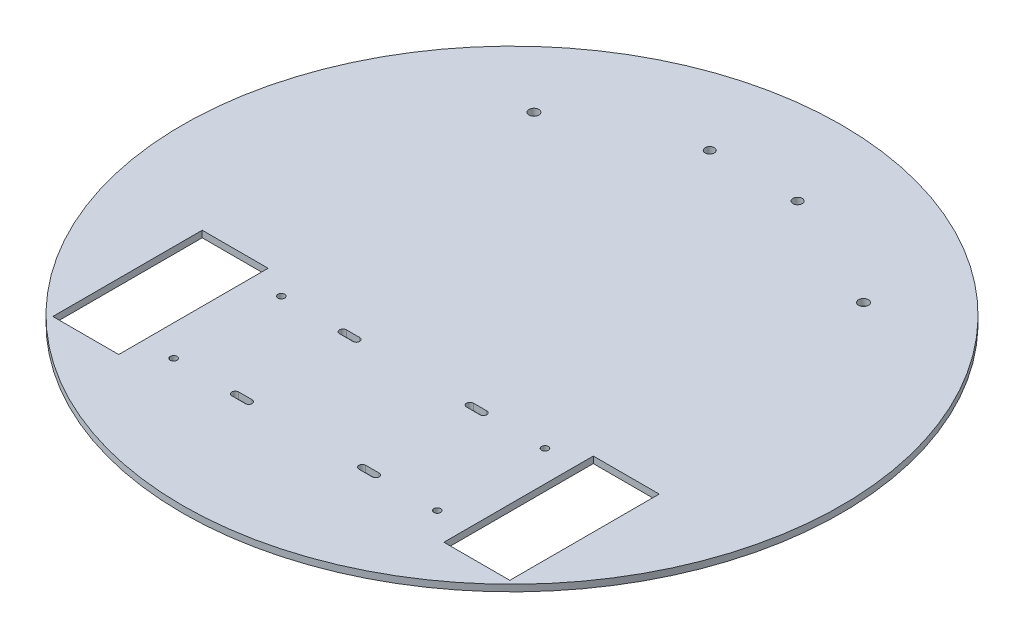
ISO-10303-21;
HEADER;
FILE_DESCRIPTION(('STEP AP214'),'2;1');
FILE_NAME('part.step','',(''),(''),'','','');
FILE_SCHEMA(('AUTOMOTIVE_DESIGN { 1 0 10303 214 1 1 1 1 }'));
ENDSEC;
DATA;
#1=APPLICATION_CONTEXT('core data for automotive mechanical design processes');
#2=APPLICATION_PROTOCOL_DEFINITION('international standard','automotive_design',2000,#1);
#3=PRODUCT_CONTEXT('',#1,'mechanical');
#4=PRODUCT('Part','Part','',(#3));
#5=PRODUCT_RELATED_PRODUCT_CATEGORY('part','',(#4));
#6=PRODUCT_DEFINITION_FORMATION('','',#4);
#7=PRODUCT_DEFINITION_CONTEXT('part definition',#1,'design');
#8=PRODUCT_DEFINITION('design','',#6,#7);
#9=PRODUCT_DEFINITION_SHAPE('','',#8);
#10=(LENGTH_UNIT() NAMED_UNIT(*) SI_UNIT(.MILLI.,.METRE.));
#11=(NAMED_UNIT(*) PLANE_ANGLE_UNIT() SI_UNIT($,.RADIAN.));
#12=(NAMED_UNIT(*) SI_UNIT($,.STERADIAN.) SOLID_ANGLE_UNIT());
#13=UNCERTAINTY_MEASURE_WITH_UNIT(LENGTH_MEASURE(1.E-05),#10,'distance_accuracy_value','');
#14=(GEOMETRIC_REPRESENTATION_CONTEXT(3) GLOBAL_UNCERTAINTY_ASSIGNED_CONTEXT((#13)) GLOBAL_UNIT_ASSIGNED_CONTEXT((#10,
#11,#12)) REPRESENTATION_CONTEXT('',''));
#15=CARTESIAN_POINT('',(0.,0.,0.));
#16=DIRECTION('',(0.,0.,1.));
#17=DIRECTION('',(1.,0.,0.));
#18=AXIS2_PLACEMENT_3D('',#15,#16,#17);
#19=CARTESIAN_POINT('',(0.,3.,0.));
#20=DIRECTION('',(0.,1.,0.));
#21=DIRECTION('',(0.,0.,1.));
#22=AXIS2_PLACEMENT_3D('',#19,#20,#21);
#23=PLANE('',#22);
#24=CARTESIAN_POINT('',(-20.,3.,-110.));
#25=DIRECTION('',(0.,1.,0.));
#26=DIRECTION('',(0.,0.,1.));
#27=AXIS2_PLACEMENT_3D('',#24,#25,#26);
#28=CIRCLE('',#27,2.1);
#29=CARTESIAN_POINT('',(-20.,3.,-107.9));
#30=VERTEX_POINT('',#29);
#31=EDGE_CURVE('E438',#30,#30,#28,.T.);
#32=ORIENTED_EDGE('',*,*,#31,.F.);
#33=EDGE_LOOP('',(#32));
#34=FACE_BOUND('',#33,.T.);
#35=CARTESIAN_POINT('',(-75.,3.,-85.));
#36=DIRECTION('',(0.,1.,0.));
#37=DIRECTION('',(0.,0.,1.));
#38=AXIS2_PLACEMENT_3D('',#35,#36,#37);
#39=CIRCLE('',#38,2.25);
#40=CARTESIAN_POINT('',(-75.,3.,-82.75));
#41=VERTEX_POINT('',#40);
#42=EDGE_CURVE('E223',#41,#41,#39,.T.);
#43=ORIENTED_EDGE('',*,*,#42,.F.);
#44=EDGE_LOOP('',(#43));
#45=FACE_BOUND('',#44,.T.);
#46=CARTESIAN_POINT('',(59.9999999999999,3.,93.9999999999998));
#47=DIRECTION('',(0.,1.,0.));
#48=DIRECTION('',(0.,0.,-1.));
#49=AXIS2_PLACEMENT_3D('',#46,#47,#48);
#50=CIRCLE('',#49,1.55);
#51=CARTESIAN_POINT('',(59.9999999999999,3.,92.4499999999998));
#52=VERTEX_POINT('',#51);
#53=EDGE_CURVE('E239',#52,#52,#50,.T.);
#54=ORIENTED_EDGE('',*,*,#53,.F.);
#55=EDGE_LOOP('',(#54));
#56=FACE_BOUND('',#55,.T.);
#57=DIRECTION('',(1.,0.,0.));
#58=VECTOR('',#57,1.);
#59=CARTESIAN_POINT('',(-31.95,3.,46.55));
#60=LINE('',#59,#58);
#61=CARTESIAN_POINT('',(-31.95,3.,46.55));
#62=VERTEX_POINT('',#61);
#63=CARTESIAN_POINT('',(-25.85,3.,46.55));
#64=VERTEX_POINT('',#63);
#65=EDGE_CURVE('E377',#62,#64,#60,.T.);
#66=ORIENTED_EDGE('',*,*,#65,.F.);
#67=CARTESIAN_POINT('',(-31.95,3.,45.));
#68=DIRECTION('',(0.,1.,0.));
#69=DIRECTION('',(0.,0.,1.));
#70=AXIS2_PLACEMENT_3D('',#67,#68,#69);
#71=CIRCLE('',#70,1.55000000000001);
#72=CARTESIAN_POINT('',(-31.95,3.,43.45));
#73=VERTEX_POINT('',#72);
#74=EDGE_CURVE('E375',#73,#62,#71,.T.);
#75=ORIENTED_EDGE('',*,*,#74,.F.);
#76=DIRECTION('',(-1.,0.,0.));
#77=VECTOR('',#76,1.);
#78=CARTESIAN_POINT('',(-31.95,3.,43.45));
#79=LINE('',#78,#77);
#80=CARTESIAN_POINT('',(-25.85,3.,43.45));
#81=VERTEX_POINT('',#80);
#82=EDGE_CURVE('E383',#81,#73,#79,.T.);
#83=ORIENTED_EDGE('',*,*,#82,.F.);
#84=CARTESIAN_POINT('',(-25.85,3.,45.));
#85=DIRECTION('',(0.,1.,0.));
#86=DIRECTION('',(0.,0.,1.));
#87=AXIS2_PLACEMENT_3D('',#84,#85,#86);
#88=CIRCLE('',#87,1.55000000000001);
#89=EDGE_CURVE('E380',#64,#81,#88,.T.);
#90=ORIENTED_EDGE('',*,*,#89,.F.);
#91=EDGE_LOOP('',(#66,#75,#83,#90));
#92=FACE_BOUND('',#91,.T.);
#93=CARTESIAN_POINT('',(-60.,3.,45.));
#94=DIRECTION('',(0.,1.,0.));
#95=DIRECTION('',(0.,0.,1.));
#96=AXIS2_PLACEMENT_3D('',#93,#94,#95);
#97=CIRCLE('',#96,1.54999999999999);
#98=CARTESIAN_POINT('',(-60.,3.,46.55));
#99=VERTEX_POINT('',#98);
#100=EDGE_CURVE('E406',#99,#99,#97,.T.);
#101=ORIENTED_EDGE('',*,*,#100,.F.);
#102=EDGE_LOOP('',(#101));
#103=FACE_BOUND('',#102,.T.);
#104=CARTESIAN_POINT('',(0.,3.,0.));
#105=DIRECTION('',(0.,1.,0.));
#106=DIRECTION('',(0.,0.,1.));
#107=AXIS2_PLACEMENT_3D('',#104,#105,#106);
#108=CIRCLE('',#107,150.);
#109=CARTESIAN_POINT('',(0.,3.,150.));
#110=VERTEX_POINT('',#109);
#111=EDGE_CURVE('E11',#110,#110,#108,.T.);
#112=ORIENTED_EDGE('',*,*,#111,.T.);
#113=EDGE_LOOP('',(#112));
#114=FACE_BOUND('',#113,.T.);
#115=CARTESIAN_POINT('',(-59.9999999999999,3.,94.));
#116=DIRECTION('',(0.,1.,0.));
#117=DIRECTION('',(0.,0.,1.));
#118=AXIS2_PLACEMENT_3D('',#115,#116,#117);
#119=CIRCLE('',#118,1.55);
#120=CARTESIAN_POINT('',(-59.9999999999999,3.,95.55));
#121=VERTEX_POINT('',#120);
#122=EDGE_CURVE('E369',#121,#121,#119,.T.);
#123=ORIENTED_EDGE('',*,*,#122,.F.);
#124=EDGE_LOOP('',(#123));
#125=FACE_BOUND('',#124,.T.);
#126=DIRECTION('',(1.,0.,0.));
#127=VECTOR('',#126,1.);
#128=CARTESIAN_POINT('',(-31.9499999999999,3.,95.55));
#129=LINE('',#128,#127);
#130=CARTESIAN_POINT('',(-31.9499999999999,3.,95.55));
#131=VERTEX_POINT('',#130);
#132=CARTESIAN_POINT('',(-25.8499999999999,3.,95.55));
#133=VERTEX_POINT('',#132);
#134=EDGE_CURVE('E340',#131,#133,#129,.T.);
#135=ORIENTED_EDGE('',*,*,#134,.F.);
#136=CARTESIAN_POINT('',(-31.9499999999999,3.,94.));
#137=DIRECTION('',(0.,1.,0.));
#138=DIRECTION('',(0.,0.,1.));
#139=AXIS2_PLACEMENT_3D('',#136,#137,#138);
#140=CIRCLE('',#139,1.55);
#141=CARTESIAN_POINT('',(-31.9499999999999,3.,92.45));
#142=VERTEX_POINT('',#141);
#143=EDGE_CURVE('E338',#142,#131,#140,.T.);
#144=ORIENTED_EDGE('',*,*,#143,.F.);
#145=DIRECTION('',(-1.,0.,0.));
#146=VECTOR('',#145,1.);
#147=CARTESIAN_POINT('',(-31.9499999999999,3.,92.45));
#148=LINE('',#147,#146);
#149=CARTESIAN_POINT('',(-25.8499999999999,3.,92.45));
#150=VERTEX_POINT('',#149);
#151=EDGE_CURVE('E346',#150,#142,#148,.T.);
#152=ORIENTED_EDGE('',*,*,#151,.F.);
#153=CARTESIAN_POINT('',(-25.8499999999999,3.,94.));
#154=DIRECTION('',(0.,1.,0.));
#155=DIRECTION('',(0.,0.,1.));
#156=AXIS2_PLACEMENT_3D('',#153,#154,#155);
#157=CIRCLE('',#156,1.55);
#158=EDGE_CURVE('E343',#133,#150,#157,.T.);
#159=ORIENTED_EDGE('',*,*,#158,.F.);
#160=EDGE_LOOP('',(#135,#144,#152,#159));
#161=FACE_BOUND('',#160,.T.);
#162=DIRECTION('',(-1.,0.,0.));
#163=VECTOR('',#162,1.);
#164=CARTESIAN_POINT('',(31.95,3.,43.4499999999998));
#165=LINE('',#164,#163);
#166=CARTESIAN_POINT('',(31.95,3.,43.4499999999998));
#167=VERTEX_POINT('',#166);
#168=CARTESIAN_POINT('',(25.85,3.,43.4499999999998));
#169=VERTEX_POINT('',#168);
#170=EDGE_CURVE('E309',#167,#169,#165,.T.);
#171=ORIENTED_EDGE('',*,*,#170,.F.);
#172=CARTESIAN_POINT('',(31.95,3.,44.9999999999998));
#173=DIRECTION('',(0.,1.,0.));
#174=DIRECTION('',(0.,0.,-1.));
#175=AXIS2_PLACEMENT_3D('',#172,#173,#174);
#176=CIRCLE('',#175,1.55000000000001);
#177=CARTESIAN_POINT('',(31.95,3.,46.5499999999998));
#178=VERTEX_POINT('',#177);
#179=EDGE_CURVE('E307',#178,#167,#176,.T.);
#180=ORIENTED_EDGE('',*,*,#179,.F.);
#181=DIRECTION('',(1.,0.,0.));
#182=VECTOR('',#181,1.);
#183=CARTESIAN_POINT('',(31.95,3.,46.5499999999998));
#184=LINE('',#183,#182);
#185=CARTESIAN_POINT('',(25.85,3.,46.5499999999998));
#186=VERTEX_POINT('',#185);
#187=EDGE_CURVE('E315',#186,#178,#184,.T.);
#188=ORIENTED_EDGE('',*,*,#187,.F.);
#189=CARTESIAN_POINT('',(25.85,3.,44.9999999999998));
#190=DIRECTION('',(0.,1.,0.));
#191=DIRECTION('',(0.,0.,-1.));
#192=AXIS2_PLACEMENT_3D('',#189,#190,#191);
#193=CIRCLE('',#192,1.55000000000001);
#194=EDGE_CURVE('E312',#169,#186,#193,.T.);
#195=ORIENTED_EDGE('',*,*,#194,.F.);
#196=EDGE_LOOP('',(#171,#180,#188,#195));
#197=FACE_BOUND('',#196,.T.);
#198=DIRECTION('',(-1.,0.,0.));
#199=VECTOR('',#198,1.);
#200=CARTESIAN_POINT('',(31.9499999999999,3.,92.4499999999998));
#201=LINE('',#200,#199);
#202=CARTESIAN_POINT('',(31.9499999999999,3.,92.4499999999998));
#203=VERTEX_POINT('',#202);
#204=CARTESIAN_POINT('',(25.8499999999999,3.,92.4499999999998));
#205=VERTEX_POINT('',#204);
#206=EDGE_CURVE('E278',#203,#205,#201,.T.);
#207=ORIENTED_EDGE('',*,*,#206,.F.);
#208=CARTESIAN_POINT('',(31.9499999999999,3.,93.9999999999998));
#209=DIRECTION('',(0.,1.,0.));
#210=DIRECTION('',(0.,0.,-1.));
#211=AXIS2_PLACEMENT_3D('',#208,#209,#210);
#212=CIRCLE('',#211,1.55);
#213=CARTESIAN_POINT('',(31.9499999999999,3.,95.5499999999998));
#214=VERTEX_POINT('',#213);
#215=EDGE_CURVE('E276',#214,#203,#212,.T.);
#216=ORIENTED_EDGE('',*,*,#215,.F.);
#217=DIRECTION('',(1.,0.,0.));
#218=VECTOR('',#217,1.);
#219=CARTESIAN_POINT('',(31.9499999999999,3.,95.5499999999998));
#220=LINE('',#219,#218);
#221=CARTESIAN_POINT('',(25.8499999999999,3.,95.5499999999998));
#222=VERTEX_POINT('',#221);
#223=EDGE_CURVE('E284',#222,#214,#220,.T.);
#224=ORIENTED_EDGE('',*,*,#223,.F.);
#225=CARTESIAN_POINT('',(25.8499999999999,3.,93.9999999999998));
#226=DIRECTION('',(0.,1.,0.));
#227=DIRECTION('',(0.,0.,-1.));
#228=AXIS2_PLACEMENT_3D('',#225,#226,#227);
#229=CIRCLE('',#228,1.55);
#230=EDGE_CURVE('E281',#205,#222,#229,.T.);
#231=ORIENTED_EDGE('',*,*,#230,.F.);
#232=EDGE_LOOP('',(#207,#216,#224,#231));
#233=FACE_BOUND('',#232,.T.);
#234=DIRECTION('',(-1.,0.,0.));
#235=VECTOR('',#234,1.);
#236=CARTESIAN_POINT('',(104.,3.,36.9999999999998));
#237=LINE('',#236,#235);
#238=CARTESIAN_POINT('',(104.,3.,36.9999999999998));
#239=VERTEX_POINT('',#238);
#240=CARTESIAN_POINT('',(74.,3.,36.9999999999998));
#241=VERTEX_POINT('',#240);
#242=EDGE_CURVE('E247',#239,#241,#237,.T.);
#243=ORIENTED_EDGE('',*,*,#242,.F.);
#244=DIRECTION('',(0.,0.,-1.));
#245=VECTOR('',#244,1.);
#246=CARTESIAN_POINT('',(104.,3.,36.9999999999998));
#247=LINE('',#246,#245);
#248=CARTESIAN_POINT('',(104.,3.,105.));
#249=VERTEX_POINT('',#248);
#250=EDGE_CURVE('E245',#249,#239,#247,.T.);
#251=ORIENTED_EDGE('',*,*,#250,.F.);
#252=DIRECTION('',(1.,0.,0.));
#253=VECTOR('',#252,1.);
#254=CARTESIAN_POINT('',(104.,3.,105.));
#255=LINE('',#254,#253);
#256=CARTESIAN_POINT('',(74.,3.,105.));
#257=VERTEX_POINT('',#256);
#258=EDGE_CURVE('E253',#257,#249,#255,.T.);
#259=ORIENTED_EDGE('',*,*,#258,.F.);
#260=DIRECTION('',(0.,0.,1.));
#261=VECTOR('',#260,1.);
#262=CARTESIAN_POINT('',(74.,3.,36.9999999999998));
#263=LINE('',#262,#261);
#264=EDGE_CURVE('E250',#241,#257,#263,.T.);
#265=ORIENTED_EDGE('',*,*,#264,.F.);
#266=EDGE_LOOP('',(#243,#251,#259,#265));
#267=FACE_BOUND('',#266,.T.);
#268=CARTESIAN_POINT('',(60.,3.,44.9999999999998));
#269=DIRECTION('',(0.,1.,0.));
#270=DIRECTION('',(0.,0.,-1.));
#271=AXIS2_PLACEMENT_3D('',#268,#269,#270);
#272=CIRCLE('',#271,1.54999999999999);
#273=CARTESIAN_POINT('',(60.,3.,43.4499999999998));
#274=VERTEX_POINT('',#273);
#275=EDGE_CURVE('E233',#274,#274,#272,.T.);
#276=ORIENTED_EDGE('',*,*,#275,.F.);
#277=EDGE_LOOP('',(#276));
#278=FACE_BOUND('',#277,.T.);
#279=DIRECTION('',(1.,0.,0.));
#280=VECTOR('',#279,1.);
#281=CARTESIAN_POINT('',(-104.,3.,105.));
#282=LINE('',#281,#280);
#283=CARTESIAN_POINT('',(-104.,3.,105.));
#284=VERTEX_POINT('',#283);
#285=CARTESIAN_POINT('',(-74.,3.,105.));
#286=VERTEX_POINT('',#285);
#287=EDGE_CURVE('E202',#284,#286,#282,.T.);
#288=ORIENTED_EDGE('',*,*,#287,.F.);
#289=DIRECTION('',(0.,0.,1.));
#290=VECTOR('',#289,1.);
#291=CARTESIAN_POINT('',(-104.,3.,37.));
#292=LINE('',#291,#290);
#293=CARTESIAN_POINT('',(-104.,3.,37.));
#294=VERTEX_POINT('',#293);
#295=EDGE_CURVE('E194',#294,#284,#292,.T.);
#296=ORIENTED_EDGE('',*,*,#295,.F.);
#297=DIRECTION('',(-1.,0.,0.));
#298=VECTOR('',#297,1.);
#299=CARTESIAN_POINT('',(-104.,3.,37.));
#300=LINE('',#299,#298);
#301=CARTESIAN_POINT('',(-74.,3.,37.));
#302=VERTEX_POINT('',#301);
#303=EDGE_CURVE('E217',#302,#294,#300,.T.);
#304=ORIENTED_EDGE('',*,*,#303,.F.);
#305=DIRECTION('',(0.,0.,-1.));
#306=VECTOR('',#305,1.);
#307=CARTESIAN_POINT('',(-74.,3.,37.));
#308=LINE('',#307,#306);
#309=EDGE_CURVE('E215',#286,#302,#308,.T.);
#310=ORIENTED_EDGE('',*,*,#309,.F.);
#311=EDGE_LOOP('',(#288,#296,#304,#310));
#312=FACE_BOUND('',#311,.T.);
#313=CARTESIAN_POINT('',(75.,3.,-85.0000000000001));
#314=DIRECTION('',(0.,1.,0.));
#315=DIRECTION('',(0.,0.,-1.));
#316=AXIS2_PLACEMENT_3D('',#313,#314,#315);
#317=CIRCLE('',#316,2.25);
#318=CARTESIAN_POINT('',(75.,3.,-87.2500000000001));
#319=VERTEX_POINT('',#318);
#320=EDGE_CURVE('E624',#319,#319,#317,.T.);
#321=ORIENTED_EDGE('',*,*,#320,.F.);
#322=EDGE_LOOP('',(#321));
#323=FACE_BOUND('',#322,.T.);
#324=CARTESIAN_POINT('',(20.,3.,-110.));
#325=DIRECTION('',(0.,1.,0.));
#326=DIRECTION('',(0.,0.,-1.));
#327=AXIS2_PLACEMENT_3D('',#324,#325,#326);
#328=CIRCLE('',#327,2.1);
#329=CARTESIAN_POINT('',(20.,3.,-112.1));
#330=VERTEX_POINT('',#329);
#331=EDGE_CURVE('E611',#330,#330,#328,.T.);
#332=ORIENTED_EDGE('',*,*,#331,.F.);
#333=EDGE_LOOP('',(#332));
#334=FACE_BOUND('',#333,.T.);
#335=ADVANCED_FACE('F33',(#34,#45,#56,#92,#103,#114,#125,#161,#197,#233,#267,#278,#312,#323,
#334),#23,.T.);
#336=CARTESIAN_POINT('',(0.,0.,0.));
#337=DIRECTION('',(0.,1.,0.));
#338=DIRECTION('',(0.,0.,1.));
#339=AXIS2_PLACEMENT_3D('',#336,#337,#338);
#340=PLANE('',#339);
#341=CARTESIAN_POINT('',(60.,0.,44.9999999999998));
#342=DIRECTION('',(0.,1.,0.));
#343=DIRECTION('',(0.,0.,-1.));
#344=AXIS2_PLACEMENT_3D('',#341,#342,#343);
#345=CIRCLE('',#344,1.54999999999999);
#346=CARTESIAN_POINT('',(60.,0.,43.4499999999998));
#347=VERTEX_POINT('',#346);
#348=EDGE_CURVE('E210',#347,#347,#345,.T.);
#349=ORIENTED_EDGE('',*,*,#348,.T.);
#350=EDGE_LOOP('',(#349));
#351=FACE_BOUND('',#350,.T.);
#352=CARTESIAN_POINT('',(59.9999999999999,0.,93.9999999999998));
#353=DIRECTION('',(0.,1.,0.));
#354=DIRECTION('',(0.,0.,-1.));
#355=AXIS2_PLACEMENT_3D('',#352,#353,#354);
#356=CIRCLE('',#355,1.55);
#357=CARTESIAN_POINT('',(59.9999999999999,0.,92.4499999999998));
#358=VERTEX_POINT('',#357);
#359=EDGE_CURVE('E236',#358,#358,#356,.T.);
#360=ORIENTED_EDGE('',*,*,#359,.T.);
#361=EDGE_LOOP('',(#360));
#362=FACE_BOUND('',#361,.T.);
#363=DIRECTION('',(0.,0.,-1.));
#364=VECTOR('',#363,1.);
#365=CARTESIAN_POINT('',(104.,0.,36.9999999999998));
#366=LINE('',#365,#364);
#367=CARTESIAN_POINT('',(104.,0.,105.));
#368=VERTEX_POINT('',#367);
#369=CARTESIAN_POINT('',(104.,0.,36.9999999999998));
#370=VERTEX_POINT('',#369);
#371=EDGE_CURVE('E242',#368,#370,#366,.T.);
#372=ORIENTED_EDGE('',*,*,#371,.T.);
#373=DIRECTION('',(-1.,0.,0.));
#374=VECTOR('',#373,1.);
#375=CARTESIAN_POINT('',(104.,0.,36.9999999999998));
#376=LINE('',#375,#374);
#377=CARTESIAN_POINT('',(74.,0.,36.9999999999998));
#378=VERTEX_POINT('',#377);
#379=EDGE_CURVE('E258',#370,#378,#376,.T.);
#380=ORIENTED_EDGE('',*,*,#379,.T.);
#381=DIRECTION('',(0.,0.,1.));
#382=VECTOR('',#381,1.);
#383=CARTESIAN_POINT('',(74.,0.,36.9999999999998));
#384=LINE('',#383,#382);
#385=CARTESIAN_POINT('',(74.,0.,105.));
#386=VERTEX_POINT('',#385);
#387=EDGE_CURVE('E261',#378,#386,#384,.T.);
#388=ORIENTED_EDGE('',*,*,#387,.T.);
#389=DIRECTION('',(1.,0.,0.));
#390=VECTOR('',#389,1.);
#391=CARTESIAN_POINT('',(104.,0.,105.));
#392=LINE('',#391,#390);
#393=EDGE_CURVE('E248',#386,#368,#392,.T.);
#394=ORIENTED_EDGE('',*,*,#393,.T.);
#395=EDGE_LOOP('',(#372,#380,#388,#394));
#396=FACE_BOUND('',#395,.T.);
#397=CARTESIAN_POINT('',(31.95,0.,44.9999999999998));
#398=DIRECTION('',(0.,1.,0.));
#399=DIRECTION('',(0.,0.,-1.));
#400=AXIS2_PLACEMENT_3D('',#397,#398,#399);
#401=CIRCLE('',#400,1.55000000000001);
#402=CARTESIAN_POINT('',(31.95,0.,46.5499999999998));
#403=VERTEX_POINT('',#402);
#404=CARTESIAN_POINT('',(31.95,0.,43.4499999999998));
#405=VERTEX_POINT('',#404);
#406=EDGE_CURVE('E306',#403,#405,#401,.T.);
#407=ORIENTED_EDGE('',*,*,#406,.T.);
#408=DIRECTION('',(-1.,0.,0.));
#409=VECTOR('',#408,1.);
#410=CARTESIAN_POINT('',(31.95,0.,43.4499999999998));
#411=LINE('',#410,#409);
#412=CARTESIAN_POINT('',(25.85,0.,43.4499999999998));
#413=VERTEX_POINT('',#412);
#414=EDGE_CURVE('E320',#405,#413,#411,.T.);
#415=ORIENTED_EDGE('',*,*,#414,.T.);
#416=CARTESIAN_POINT('',(25.85,0.,44.9999999999998));
#417=DIRECTION('',(0.,1.,0.));
#418=DIRECTION('',(0.,0.,-1.));
#419=AXIS2_PLACEMENT_3D('',#416,#417,#418);
#420=CIRCLE('',#419,1.55000000000001);
#421=CARTESIAN_POINT('',(25.85,0.,46.5499999999998));
#422=VERTEX_POINT('',#421);
#423=EDGE_CURVE('E323',#413,#422,#420,.T.);
#424=ORIENTED_EDGE('',*,*,#423,.T.);
#425=DIRECTION('',(1.,0.,0.));
#426=VECTOR('',#425,1.);
#427=CARTESIAN_POINT('',(31.95,0.,46.5499999999998));
#428=LINE('',#427,#426);
#429=EDGE_CURVE('E310',#422,#403,#428,.T.);
#430=ORIENTED_EDGE('',*,*,#429,.T.);
#431=EDGE_LOOP('',(#407,#415,#424,#430));
#432=FACE_BOUND('',#431,.T.);
#433=CARTESIAN_POINT('',(-59.9999999999999,0.,94.));
#434=DIRECTION('',(0.,1.,0.));
#435=DIRECTION('',(0.,0.,1.));
#436=AXIS2_PLACEMENT_3D('',#433,#434,#435);
#437=CIRCLE('',#436,1.55);
#438=CARTESIAN_POINT('',(-59.9999999999999,0.,95.55));
#439=VERTEX_POINT('',#438);
#440=EDGE_CURVE('E368',#439,#439,#437,.T.);
#441=ORIENTED_EDGE('',*,*,#440,.T.);
#442=EDGE_LOOP('',(#441));
#443=FACE_BOUND('',#442,.T.);
#444=CARTESIAN_POINT('',(-31.95,0.,45.));
#445=DIRECTION('',(0.,1.,0.));
#446=DIRECTION('',(0.,0.,1.));
#447=AXIS2_PLACEMENT_3D('',#444,#445,#446);
#448=CIRCLE('',#447,1.55000000000001);
#449=CARTESIAN_POINT('',(-31.95,0.,43.45));
#450=VERTEX_POINT('',#449);
#451=CARTESIAN_POINT('',(-31.95,0.,46.55));
#452=VERTEX_POINT('',#451);
#453=EDGE_CURVE('E372',#450,#452,#448,.T.);
#454=ORIENTED_EDGE('',*,*,#453,.T.);
#455=DIRECTION('',(1.,0.,0.));
#456=VECTOR('',#455,1.);
#457=CARTESIAN_POINT('',(-31.95,0.,46.55));
#458=LINE('',#457,#456);
#459=CARTESIAN_POINT('',(-25.85,0.,46.55));
#460=VERTEX_POINT('',#459);
#461=EDGE_CURVE('E388',#452,#460,#458,.T.);
#462=ORIENTED_EDGE('',*,*,#461,.T.);
#463=CARTESIAN_POINT('',(-25.85,0.,45.));
#464=DIRECTION('',(0.,1.,0.));
#465=DIRECTION('',(0.,0.,1.));
#466=AXIS2_PLACEMENT_3D('',#463,#464,#465);
#467=CIRCLE('',#466,1.55000000000001);
#468=CARTESIAN_POINT('',(-25.85,0.,43.45));
#469=VERTEX_POINT('',#468);
#470=EDGE_CURVE('E391',#460,#469,#467,.T.);
#471=ORIENTED_EDGE('',*,*,#470,.T.);
#472=DIRECTION('',(-1.,0.,0.));
#473=VECTOR('',#472,1.);
#474=CARTESIAN_POINT('',(-31.95,0.,43.45));
#475=LINE('',#474,#473);
#476=EDGE_CURVE('E378',#469,#450,#475,.T.);
#477=ORIENTED_EDGE('',*,*,#476,.T.);
#478=EDGE_LOOP('',(#454,#462,#471,#477));
#479=FACE_BOUND('',#478,.T.);
#480=CARTESIAN_POINT('',(0.,0.,0.));
#481=DIRECTION('',(0.,1.,0.));
#482=DIRECTION('',(0.,0.,1.));
#483=AXIS2_PLACEMENT_3D('',#480,#481,#482);
#484=CIRCLE('',#483,150.);
#485=CARTESIAN_POINT('',(0.,0.,150.));
#486=VERTEX_POINT('',#485);
#487=EDGE_CURVE('E37',#486,#486,#484,.T.);
#488=ORIENTED_EDGE('',*,*,#487,.F.);
#489=EDGE_LOOP('',(#488));
#490=FACE_BOUND('',#489,.T.);
#491=CARTESIAN_POINT('',(-60.,0.,45.));
#492=DIRECTION('',(0.,1.,0.));
#493=DIRECTION('',(0.,0.,1.));
#494=AXIS2_PLACEMENT_3D('',#491,#492,#493);
#495=CIRCLE('',#494,1.54999999999999);
#496=CARTESIAN_POINT('',(-60.,0.,46.55));
#497=VERTEX_POINT('',#496);
#498=EDGE_CURVE('E405',#497,#497,#495,.T.);
#499=ORIENTED_EDGE('',*,*,#498,.T.);
#500=EDGE_LOOP('',(#499));
#501=FACE_BOUND('',#500,.T.);
#502=CARTESIAN_POINT('',(-31.9499999999999,0.,94.));
#503=DIRECTION('',(0.,1.,0.));
#504=DIRECTION('',(0.,0.,1.));
#505=AXIS2_PLACEMENT_3D('',#502,#503,#504);
#506=CIRCLE('',#505,1.55);
#507=CARTESIAN_POINT('',(-31.9499999999999,0.,92.45));
#508=VERTEX_POINT('',#507);
#509=CARTESIAN_POINT('',(-31.9499999999999,0.,95.55));
#510=VERTEX_POINT('',#509);
#511=EDGE_CURVE('E337',#508,#510,#506,.T.);
#512=ORIENTED_EDGE('',*,*,#511,.T.);
#513=DIRECTION('',(1.,0.,0.));
#514=VECTOR('',#513,1.);
#515=CARTESIAN_POINT('',(-31.9499999999999,0.,95.55));
#516=LINE('',#515,#514);
#517=CARTESIAN_POINT('',(-25.8499999999999,0.,95.55));
#518=VERTEX_POINT('',#517);
#519=EDGE_CURVE('E351',#510,#518,#516,.T.);
#520=ORIENTED_EDGE('',*,*,#519,.T.);
#521=CARTESIAN_POINT('',(-25.8499999999999,0.,94.));
#522=DIRECTION('',(0.,1.,0.));
#523=DIRECTION('',(0.,0.,1.));
#524=AXIS2_PLACEMENT_3D('',#521,#522,#523);
#525=CIRCLE('',#524,1.55);
#526=CARTESIAN_POINT('',(-25.8499999999999,0.,92.45));
#527=VERTEX_POINT('',#526);
#528=EDGE_CURVE('E354',#518,#527,#525,.T.);
#529=ORIENTED_EDGE('',*,*,#528,.T.);
#530=DIRECTION('',(-1.,0.,0.));
#531=VECTOR('',#530,1.);
#532=CARTESIAN_POINT('',(-31.9499999999999,0.,92.45));
#533=LINE('',#532,#531);
#534=EDGE_CURVE('E341',#527,#508,#533,.T.);
#535=ORIENTED_EDGE('',*,*,#534,.T.);
#536=EDGE_LOOP('',(#512,#520,#529,#535));
#537=FACE_BOUND('',#536,.T.);
#538=CARTESIAN_POINT('',(31.9499999999999,0.,93.9999999999998));
#539=DIRECTION('',(0.,1.,0.));
#540=DIRECTION('',(0.,0.,-1.));
#541=AXIS2_PLACEMENT_3D('',#538,#539,#540);
#542=CIRCLE('',#541,1.55);
#543=CARTESIAN_POINT('',(31.9499999999999,0.,95.5499999999998));
#544=VERTEX_POINT('',#543);
#545=CARTESIAN_POINT('',(31.9499999999999,0.,92.4499999999998));
#546=VERTEX_POINT('',#545);
#547=EDGE_CURVE('E275',#544,#546,#542,.T.);
#548=ORIENTED_EDGE('',*,*,#547,.T.);
#549=DIRECTION('',(-1.,0.,0.));
#550=VECTOR('',#549,1.);
#551=CARTESIAN_POINT('',(31.9499999999999,0.,92.4499999999998));
#552=LINE('',#551,#550);
#553=CARTESIAN_POINT('',(25.8499999999999,0.,92.4499999999998));
#554=VERTEX_POINT('',#553);
#555=EDGE_CURVE('E289',#546,#554,#552,.T.);
#556=ORIENTED_EDGE('',*,*,#555,.T.);
#557=CARTESIAN_POINT('',(25.8499999999999,0.,93.9999999999998));
#558=DIRECTION('',(0.,1.,0.));
#559=DIRECTION('',(0.,0.,-1.));
#560=AXIS2_PLACEMENT_3D('',#557,#558,#559);
#561=CIRCLE('',#560,1.55);
#562=CARTESIAN_POINT('',(25.8499999999999,0.,95.5499999999998));
#563=VERTEX_POINT('',#562);
#564=EDGE_CURVE('E292',#554,#563,#561,.T.);
#565=ORIENTED_EDGE('',*,*,#564,.T.);
#566=DIRECTION('',(1.,0.,0.));
#567=VECTOR('',#566,1.);
#568=CARTESIAN_POINT('',(31.9499999999999,0.,95.5499999999998));
#569=LINE('',#568,#567);
#570=EDGE_CURVE('E279',#563,#544,#569,.T.);
#571=ORIENTED_EDGE('',*,*,#570,.T.);
#572=EDGE_LOOP('',(#548,#556,#565,#571));
#573=FACE_BOUND('',#572,.T.);
#574=DIRECTION('',(0.,0.,1.));
#575=VECTOR('',#574,1.);
#576=CARTESIAN_POINT('',(-104.,0.,37.));
#577=LINE('',#576,#575);
#578=CARTESIAN_POINT('',(-104.,0.,37.));
#579=VERTEX_POINT('',#578);
#580=CARTESIAN_POINT('',(-104.,0.,105.));
#581=VERTEX_POINT('',#580);
#582=EDGE_CURVE('E56',#579,#581,#577,.T.);
#583=ORIENTED_EDGE('',*,*,#582,.T.);
#584=DIRECTION('',(1.,0.,0.));
#585=VECTOR('',#584,1.);
#586=CARTESIAN_POINT('',(-104.,0.,105.));
#587=LINE('',#586,#585);
#588=CARTESIAN_POINT('',(-74.,0.,105.));
#589=VERTEX_POINT('',#588);
#590=EDGE_CURVE('E209',#581,#589,#587,.T.);
#591=ORIENTED_EDGE('',*,*,#590,.T.);
#592=DIRECTION('',(0.,0.,-1.));
#593=VECTOR('',#592,1.);
#594=CARTESIAN_POINT('',(-74.,0.,37.));
#595=LINE('',#594,#593);
#596=CARTESIAN_POINT('',(-74.,0.,37.));
#597=VERTEX_POINT('',#596);
#598=EDGE_CURVE('E225',#589,#597,#595,.T.);
#599=ORIENTED_EDGE('',*,*,#598,.T.);
#600=DIRECTION('',(-1.,0.,0.));
#601=VECTOR('',#600,1.);
#602=CARTESIAN_POINT('',(-104.,0.,37.));
#603=LINE('',#602,#601);
#604=EDGE_CURVE('E203',#597,#579,#603,.T.);
#605=ORIENTED_EDGE('',*,*,#604,.T.);
#606=EDGE_LOOP('',(#583,#591,#599,#605));
#607=FACE_BOUND('',#606,.T.);
#608=CARTESIAN_POINT('',(-75.,0.,-85.));
#609=DIRECTION('',(0.,1.,0.));
#610=DIRECTION('',(0.,0.,1.));
#611=AXIS2_PLACEMENT_3D('',#608,#609,#610);
#612=CIRCLE('',#611,2.25);
#613=CARTESIAN_POINT('',(-75.,0.,-82.75));
#614=VERTEX_POINT('',#613);
#615=EDGE_CURVE('E627',#614,#614,#612,.T.);
#616=ORIENTED_EDGE('',*,*,#615,.T.);
#617=EDGE_LOOP('',(#616));
#618=FACE_BOUND('',#617,.T.);
#619=CARTESIAN_POINT('',(75.,0.,-85.0000000000001));
#620=DIRECTION('',(0.,1.,0.));
#621=DIRECTION('',(0.,0.,-1.));
#622=AXIS2_PLACEMENT_3D('',#619,#620,#621);
#623=CIRCLE('',#622,2.25);
#624=CARTESIAN_POINT('',(75.,0.,-87.2500000000001));
#625=VERTEX_POINT('',#624);
#626=EDGE_CURVE('E621',#625,#625,#623,.T.);
#627=ORIENTED_EDGE('',*,*,#626,.T.);
#628=EDGE_LOOP('',(#627));
#629=FACE_BOUND('',#628,.T.);
#630=CARTESIAN_POINT('',(-20.,0.,-110.));
#631=DIRECTION('',(0.,1.,0.));
#632=DIRECTION('',(0.,0.,1.));
#633=AXIS2_PLACEMENT_3D('',#630,#631,#632);
#634=CIRCLE('',#633,2.1);
#635=CARTESIAN_POINT('',(-20.,0.,-107.9));
#636=VERTEX_POINT('',#635);
#637=EDGE_CURVE('E617',#636,#636,#634,.T.);
#638=ORIENTED_EDGE('',*,*,#637,.T.);
#639=EDGE_LOOP('',(#638));
#640=FACE_BOUND('',#639,.T.);
#641=CARTESIAN_POINT('',(20.,0.,-110.));
#642=DIRECTION('',(0.,1.,0.));
#643=DIRECTION('',(0.,0.,-1.));
#644=AXIS2_PLACEMENT_3D('',#641,#642,#643);
#645=CIRCLE('',#644,2.1);
#646=CARTESIAN_POINT('',(20.,0.,-112.1));
#647=VERTEX_POINT('',#646);
#648=EDGE_CURVE('E614',#647,#647,#645,.T.);
#649=ORIENTED_EDGE('',*,*,#648,.T.);
#650=EDGE_LOOP('',(#649));
#651=FACE_BOUND('',#650,.T.);
#652=ADVANCED_FACE('F412',(#351,#362,#396,#432,#443,#479,#490,#501,#537,#573,#607,#618,#629,
#640,#651),#340,.F.);
#653=CARTESIAN_POINT('',(0.,3.,0.));
#654=DIRECTION('',(0.,-1.,0.));
#655=DIRECTION('',(0.,0.,-1.));
#656=AXIS2_PLACEMENT_3D('',#653,#654,#655);
#657=CYLINDRICAL_SURFACE('',#656,150.);
#658=ORIENTED_EDGE('',*,*,#111,.F.);
#659=EDGE_LOOP('',(#658));
#660=FACE_BOUND('',#659,.T.);
#661=ORIENTED_EDGE('',*,*,#487,.T.);
#662=EDGE_LOOP('',(#661));
#663=FACE_BOUND('',#662,.T.);
#664=ADVANCED_FACE('F35',(#660,#663),#657,.T.);
#665=CARTESIAN_POINT('',(-60.,3.,45.));
#666=DIRECTION('',(0.,-1.,0.));
#667=DIRECTION('',(0.,0.,-1.));
#668=AXIS2_PLACEMENT_3D('',#665,#666,#667);
#669=CYLINDRICAL_SURFACE('',#668,1.54999999999999);
#670=ORIENTED_EDGE('',*,*,#100,.T.);
#671=EDGE_LOOP('',(#670));
#672=FACE_BOUND('',#671,.T.);
#673=ORIENTED_EDGE('',*,*,#498,.F.);
#674=EDGE_LOOP('',(#673));
#675=FACE_BOUND('',#674,.T.);
#676=ADVANCED_FACE('F415',(#672,#675),#669,.F.);
#677=CARTESIAN_POINT('',(-31.95,3.,45.));
#678=DIRECTION('',(0.,-1.,0.));
#679=DIRECTION('',(0.,0.,-1.));
#680=AXIS2_PLACEMENT_3D('',#677,#678,#679);
#681=CYLINDRICAL_SURFACE('',#680,1.55000000000001);
#682=ORIENTED_EDGE('',*,*,#453,.F.);
#683=DIRECTION('',(0.,-1.,0.));
#684=VECTOR('',#683,1.);
#685=CARTESIAN_POINT('',(-31.95,3.,43.45));
#686=LINE('',#685,#684);
#687=EDGE_CURVE('E385',#73,#450,#686,.T.);
#688=ORIENTED_EDGE('',*,*,#687,.F.);
#689=ORIENTED_EDGE('',*,*,#74,.T.);
#690=DIRECTION('',(0.,-1.,0.));
#691=VECTOR('',#690,1.);
#692=CARTESIAN_POINT('',(-31.95,3.,46.55));
#693=LINE('',#692,#691);
#694=EDGE_CURVE('E402',#62,#452,#693,.T.);
#695=ORIENTED_EDGE('',*,*,#694,.T.);
#696=EDGE_LOOP('',(#682,#688,#689,#695));
#697=FACE_BOUND('',#696,.T.);
#698=ADVANCED_FACE('F417',(#697),#681,.F.);
#699=CARTESIAN_POINT('',(-31.95,3.,46.55));
#700=DIRECTION('',(0.,0.,-1.));
#701=DIRECTION('',(-1.,0.,0.));
#702=AXIS2_PLACEMENT_3D('',#699,#700,#701);
#703=PLANE('',#702);
#704=ORIENTED_EDGE('',*,*,#461,.F.);
#705=ORIENTED_EDGE('',*,*,#694,.F.);
#706=ORIENTED_EDGE('',*,*,#65,.T.);
#707=DIRECTION('',(0.,-1.,0.));
#708=VECTOR('',#707,1.);
#709=CARTESIAN_POINT('',(-25.85,3.,46.55));
#710=LINE('',#709,#708);
#711=EDGE_CURVE('E400',#64,#460,#710,.T.);
#712=ORIENTED_EDGE('',*,*,#711,.T.);
#713=EDGE_LOOP('',(#704,#705,#706,#712));
#714=FACE_BOUND('',#713,.T.);
#715=ADVANCED_FACE('F424',(#714),#703,.T.);
#716=CARTESIAN_POINT('',(-25.85,3.,45.));
#717=DIRECTION('',(0.,-1.,0.));
#718=DIRECTION('',(0.,0.,-1.));
#719=AXIS2_PLACEMENT_3D('',#716,#717,#718);
#720=CYLINDRICAL_SURFACE('',#719,1.55000000000001);
#721=ORIENTED_EDGE('',*,*,#470,.F.);
#722=ORIENTED_EDGE('',*,*,#711,.F.);
#723=ORIENTED_EDGE('',*,*,#89,.T.);
#724=DIRECTION('',(0.,-1.,0.));
#725=VECTOR('',#724,1.);
#726=CARTESIAN_POINT('',(-25.85,3.,43.45));
#727=LINE('',#726,#725);
#728=EDGE_CURVE('E398',#81,#469,#727,.T.);
#729=ORIENTED_EDGE('',*,*,#728,.T.);
#730=EDGE_LOOP('',(#721,#722,#723,#729));
#731=FACE_BOUND('',#730,.T.);
#732=ADVANCED_FACE('F499',(#731),#720,.F.);
#733=CARTESIAN_POINT('',(-31.95,3.,43.45));
#734=DIRECTION('',(0.,0.,1.));
#735=DIRECTION('',(1.,0.,0.));
#736=AXIS2_PLACEMENT_3D('',#733,#734,#735);
#737=PLANE('',#736);
#738=ORIENTED_EDGE('',*,*,#476,.F.);
#739=ORIENTED_EDGE('',*,*,#728,.F.);
#740=ORIENTED_EDGE('',*,*,#82,.T.);
#741=ORIENTED_EDGE('',*,*,#687,.T.);
#742=EDGE_LOOP('',(#738,#739,#740,#741));
#743=FACE_BOUND('',#742,.T.);
#744=ADVANCED_FACE('F493',(#743),#737,.T.);
#745=CARTESIAN_POINT('',(-59.9999999999999,3.,94.));
#746=DIRECTION('',(0.,-1.,0.));
#747=DIRECTION('',(0.,0.,-1.));
#748=AXIS2_PLACEMENT_3D('',#745,#746,#747);
#749=CYLINDRICAL_SURFACE('',#748,1.55);
#750=ORIENTED_EDGE('',*,*,#122,.T.);
#751=EDGE_LOOP('',(#750));
#752=FACE_BOUND('',#751,.T.);
#753=ORIENTED_EDGE('',*,*,#440,.F.);
#754=EDGE_LOOP('',(#753));
#755=FACE_BOUND('',#754,.T.);
#756=ADVANCED_FACE('F506',(#752,#755),#749,.F.);
#757=CARTESIAN_POINT('',(-31.9499999999999,3.,94.));
#758=DIRECTION('',(0.,-1.,0.));
#759=DIRECTION('',(0.,0.,-1.));
#760=AXIS2_PLACEMENT_3D('',#757,#758,#759);
#761=CYLINDRICAL_SURFACE('',#760,1.55);
#762=ORIENTED_EDGE('',*,*,#511,.F.);
#763=DIRECTION('',(0.,-1.,0.));
#764=VECTOR('',#763,1.);
#765=CARTESIAN_POINT('',(-31.9499999999999,3.,92.45));
#766=LINE('',#765,#764);
#767=EDGE_CURVE('E348',#142,#508,#766,.T.);
#768=ORIENTED_EDGE('',*,*,#767,.F.);
#769=ORIENTED_EDGE('',*,*,#143,.T.);
#770=DIRECTION('',(0.,-1.,0.));
#771=VECTOR('',#770,1.);
#772=CARTESIAN_POINT('',(-31.9499999999999,3.,95.55));
#773=LINE('',#772,#771);
#774=EDGE_CURVE('E365',#131,#510,#773,.T.);
#775=ORIENTED_EDGE('',*,*,#774,.T.);
#776=EDGE_LOOP('',(#762,#768,#769,#775));
#777=FACE_BOUND('',#776,.T.);
#778=ADVANCED_FACE('F512',(#777),#761,.F.);
#779=CARTESIAN_POINT('',(-31.9499999999999,3.,95.55));
#780=DIRECTION('',(0.,0.,-1.));
#781=DIRECTION('',(-1.,0.,0.));
#782=AXIS2_PLACEMENT_3D('',#779,#780,#781);
#783=PLANE('',#782);
#784=ORIENTED_EDGE('',*,*,#519,.F.);
#785=ORIENTED_EDGE('',*,*,#774,.F.);
#786=ORIENTED_EDGE('',*,*,#134,.T.);
#787=DIRECTION('',(0.,-1.,0.));
#788=VECTOR('',#787,1.);
#789=CARTESIAN_POINT('',(-25.8499999999999,3.,95.55));
#790=LINE('',#789,#788);
#791=EDGE_CURVE('E363',#133,#518,#790,.T.);
#792=ORIENTED_EDGE('',*,*,#791,.T.);
#793=EDGE_LOOP('',(#784,#785,#786,#792));
#794=FACE_BOUND('',#793,.T.);
#795=ADVANCED_FACE('F516',(#794),#783,.T.);
#796=CARTESIAN_POINT('',(-25.8499999999999,3.,94.));
#797=DIRECTION('',(0.,-1.,0.));
#798=DIRECTION('',(0.,0.,-1.));
#799=AXIS2_PLACEMENT_3D('',#796,#797,#798);
#800=CYLINDRICAL_SURFACE('',#799,1.55);
#801=ORIENTED_EDGE('',*,*,#528,.F.);
#802=ORIENTED_EDGE('',*,*,#791,.F.);
#803=ORIENTED_EDGE('',*,*,#158,.T.);
#804=DIRECTION('',(0.,-1.,0.));
#805=VECTOR('',#804,1.);
#806=CARTESIAN_POINT('',(-25.8499999999999,3.,92.45));
#807=LINE('',#806,#805);
#808=EDGE_CURVE('E361',#150,#527,#807,.T.);
#809=ORIENTED_EDGE('',*,*,#808,.T.);
#810=EDGE_LOOP('',(#801,#802,#803,#809));
#811=FACE_BOUND('',#810,.T.);
#812=ADVANCED_FACE('F520',(#811),#800,.F.);
#813=CARTESIAN_POINT('',(-31.9499999999999,3.,92.45));
#814=DIRECTION('',(0.,0.,1.));
#815=DIRECTION('',(1.,0.,0.));
#816=AXIS2_PLACEMENT_3D('',#813,#814,#815);
#817=PLANE('',#816);
#818=ORIENTED_EDGE('',*,*,#534,.F.);
#819=ORIENTED_EDGE('',*,*,#808,.F.);
#820=ORIENTED_EDGE('',*,*,#151,.T.);
#821=ORIENTED_EDGE('',*,*,#767,.T.);
#822=EDGE_LOOP('',(#818,#819,#820,#821));
#823=FACE_BOUND('',#822,.T.);
#824=ADVANCED_FACE('F524',(#823),#817,.T.);
#825=CARTESIAN_POINT('',(31.95,3.,44.9999999999998));
#826=DIRECTION('',(0.,-1.,0.));
#827=DIRECTION('',(0.,0.,-1.));
#828=AXIS2_PLACEMENT_3D('',#825,#826,#827);
#829=CYLINDRICAL_SURFACE('',#828,1.55000000000001);
#830=ORIENTED_EDGE('',*,*,#406,.F.);
#831=DIRECTION('',(0.,-1.,0.));
#832=VECTOR('',#831,1.);
#833=CARTESIAN_POINT('',(31.95,3.,46.5499999999998));
#834=LINE('',#833,#832);
#835=EDGE_CURVE('E317',#178,#403,#834,.T.);
#836=ORIENTED_EDGE('',*,*,#835,.F.);
#837=ORIENTED_EDGE('',*,*,#179,.T.);
#838=DIRECTION('',(0.,-1.,0.));
#839=VECTOR('',#838,1.);
#840=CARTESIAN_POINT('',(31.95,3.,43.4499999999998));
#841=LINE('',#840,#839);
#842=EDGE_CURVE('E334',#167,#405,#841,.T.);
#843=ORIENTED_EDGE('',*,*,#842,.T.);
#844=EDGE_LOOP('',(#830,#836,#837,#843));
#845=FACE_BOUND('',#844,.T.);
#846=ADVANCED_FACE('F528',(#845),#829,.F.);
#847=CARTESIAN_POINT('',(31.95,3.,43.4499999999998));
#848=DIRECTION('',(0.,0.,1.));
#849=DIRECTION('',(1.,0.,0.));
#850=AXIS2_PLACEMENT_3D('',#847,#848,#849);
#851=PLANE('',#850);
#852=ORIENTED_EDGE('',*,*,#414,.F.);
#853=ORIENTED_EDGE('',*,*,#842,.F.);
#854=ORIENTED_EDGE('',*,*,#170,.T.);
#855=DIRECTION('',(0.,-1.,0.));
#856=VECTOR('',#855,1.);
#857=CARTESIAN_POINT('',(25.85,3.,43.4499999999998));
#858=LINE('',#857,#856);
#859=EDGE_CURVE('E332',#169,#413,#858,.T.);
#860=ORIENTED_EDGE('',*,*,#859,.T.);
#861=EDGE_LOOP('',(#852,#853,#854,#860));
#862=FACE_BOUND('',#861,.T.);
#863=ADVANCED_FACE('F532',(#862),#851,.T.);
#864=CARTESIAN_POINT('',(25.85,3.,44.9999999999998));
#865=DIRECTION('',(0.,-1.,0.));
#866=DIRECTION('',(0.,0.,-1.));
#867=AXIS2_PLACEMENT_3D('',#864,#865,#866);
#868=CYLINDRICAL_SURFACE('',#867,1.55000000000001);
#869=ORIENTED_EDGE('',*,*,#423,.F.);
#870=ORIENTED_EDGE('',*,*,#859,.F.);
#871=ORIENTED_EDGE('',*,*,#194,.T.);
#872=DIRECTION('',(0.,-1.,0.));
#873=VECTOR('',#872,1.);
#874=CARTESIAN_POINT('',(25.85,3.,46.5499999999998));
#875=LINE('',#874,#873);
#876=EDGE_CURVE('E330',#186,#422,#875,.T.);
#877=ORIENTED_EDGE('',*,*,#876,.T.);
#878=EDGE_LOOP('',(#869,#870,#871,#877));
#879=FACE_BOUND('',#878,.T.);
#880=ADVANCED_FACE('F536',(#879),#868,.F.);
#881=CARTESIAN_POINT('',(31.95,3.,46.5499999999998));
#882=DIRECTION('',(0.,0.,-1.));
#883=DIRECTION('',(-1.,0.,0.));
#884=AXIS2_PLACEMENT_3D('',#881,#882,#883);
#885=PLANE('',#884);
#886=ORIENTED_EDGE('',*,*,#429,.F.);
#887=ORIENTED_EDGE('',*,*,#876,.F.);
#888=ORIENTED_EDGE('',*,*,#187,.T.);
#889=ORIENTED_EDGE('',*,*,#835,.T.);
#890=EDGE_LOOP('',(#886,#887,#888,#889));
#891=FACE_BOUND('',#890,.T.);
#892=ADVANCED_FACE('F540',(#891),#885,.T.);
#893=CARTESIAN_POINT('',(31.9499999999999,3.,93.9999999999998));
#894=DIRECTION('',(0.,-1.,0.));
#895=DIRECTION('',(0.,0.,-1.));
#896=AXIS2_PLACEMENT_3D('',#893,#894,#895);
#897=CYLINDRICAL_SURFACE('',#896,1.55);
#898=ORIENTED_EDGE('',*,*,#547,.F.);
#899=DIRECTION('',(0.,-1.,0.));
#900=VECTOR('',#899,1.);
#901=CARTESIAN_POINT('',(31.9499999999999,3.,95.5499999999998));
#902=LINE('',#901,#900);
#903=EDGE_CURVE('E286',#214,#544,#902,.T.);
#904=ORIENTED_EDGE('',*,*,#903,.F.);
#905=ORIENTED_EDGE('',*,*,#215,.T.);
#906=DIRECTION('',(0.,-1.,0.));
#907=VECTOR('',#906,1.);
#908=CARTESIAN_POINT('',(31.9499999999999,3.,92.4499999999998));
#909=LINE('',#908,#907);
#910=EDGE_CURVE('E303',#203,#546,#909,.T.);
#911=ORIENTED_EDGE('',*,*,#910,.T.);
#912=EDGE_LOOP('',(#898,#904,#905,#911));
#913=FACE_BOUND('',#912,.T.);
#914=ADVANCED_FACE('F544',(#913),#897,.F.);
#915=CARTESIAN_POINT('',(31.9499999999999,3.,92.4499999999998));
#916=DIRECTION('',(0.,0.,1.));
#917=DIRECTION('',(1.,0.,0.));
#918=AXIS2_PLACEMENT_3D('',#915,#916,#917);
#919=PLANE('',#918);
#920=ORIENTED_EDGE('',*,*,#555,.F.);
#921=ORIENTED_EDGE('',*,*,#910,.F.);
#922=ORIENTED_EDGE('',*,*,#206,.T.);
#923=DIRECTION('',(0.,-1.,0.));
#924=VECTOR('',#923,1.);
#925=CARTESIAN_POINT('',(25.8499999999999,3.,92.4499999999998));
#926=LINE('',#925,#924);
#927=EDGE_CURVE('E301',#205,#554,#926,.T.);
#928=ORIENTED_EDGE('',*,*,#927,.T.);
#929=EDGE_LOOP('',(#920,#921,#922,#928));
#930=FACE_BOUND('',#929,.T.);
#931=ADVANCED_FACE('F548',(#930),#919,.T.);
#932=CARTESIAN_POINT('',(25.8499999999999,3.,93.9999999999998));
#933=DIRECTION('',(0.,-1.,0.));
#934=DIRECTION('',(0.,0.,-1.));
#935=AXIS2_PLACEMENT_3D('',#932,#933,#934);
#936=CYLINDRICAL_SURFACE('',#935,1.55);
#937=ORIENTED_EDGE('',*,*,#564,.F.);
#938=ORIENTED_EDGE('',*,*,#927,.F.);
#939=ORIENTED_EDGE('',*,*,#230,.T.);
#940=DIRECTION('',(0.,-1.,0.));
#941=VECTOR('',#940,1.);
#942=CARTESIAN_POINT('',(25.8499999999999,3.,95.5499999999998));
#943=LINE('',#942,#941);
#944=EDGE_CURVE('E299',#222,#563,#943,.T.);
#945=ORIENTED_EDGE('',*,*,#944,.T.);
#946=EDGE_LOOP('',(#937,#938,#939,#945));
#947=FACE_BOUND('',#946,.T.);
#948=ADVANCED_FACE('F552',(#947),#936,.F.);
#949=CARTESIAN_POINT('',(31.9499999999999,3.,95.5499999999998));
#950=DIRECTION('',(0.,0.,-1.));
#951=DIRECTION('',(-1.,0.,0.));
#952=AXIS2_PLACEMENT_3D('',#949,#950,#951);
#953=PLANE('',#952);
#954=ORIENTED_EDGE('',*,*,#570,.F.);
#955=ORIENTED_EDGE('',*,*,#944,.F.);
#956=ORIENTED_EDGE('',*,*,#223,.T.);
#957=ORIENTED_EDGE('',*,*,#903,.T.);
#958=EDGE_LOOP('',(#954,#955,#956,#957));
#959=FACE_BOUND('',#958,.T.);
#960=ADVANCED_FACE('F556',(#959),#953,.T.);
#961=CARTESIAN_POINT('',(104.,3.,36.9999999999998));
#962=DIRECTION('',(-1.,0.,0.));
#963=DIRECTION('',(0.,0.,1.));
#964=AXIS2_PLACEMENT_3D('',#961,#962,#963);
#965=PLANE('',#964);
#966=ORIENTED_EDGE('',*,*,#371,.F.);
#967=DIRECTION('',(0.,-1.,0.));
#968=VECTOR('',#967,1.);
#969=CARTESIAN_POINT('',(104.,3.,105.));
#970=LINE('',#969,#968);
#971=EDGE_CURVE('E255',#249,#368,#970,.T.);
#972=ORIENTED_EDGE('',*,*,#971,.F.);
#973=ORIENTED_EDGE('',*,*,#250,.T.);
#974=DIRECTION('',(0.,-1.,0.));
#975=VECTOR('',#974,1.);
#976=CARTESIAN_POINT('',(104.,3.,36.9999999999998));
#977=LINE('',#976,#975);
#978=EDGE_CURVE('E272',#239,#370,#977,.T.);
#979=ORIENTED_EDGE('',*,*,#978,.T.);
#980=EDGE_LOOP('',(#966,#972,#973,#979));
#981=FACE_BOUND('',#980,.T.);
#982=ADVANCED_FACE('F560',(#981),#965,.T.);
#983=CARTESIAN_POINT('',(104.,3.,36.9999999999998));
#984=DIRECTION('',(0.,0.,1.));
#985=DIRECTION('',(1.,0.,0.));
#986=AXIS2_PLACEMENT_3D('',#983,#984,#985);
#987=PLANE('',#986);
#988=ORIENTED_EDGE('',*,*,#379,.F.);
#989=ORIENTED_EDGE('',*,*,#978,.F.);
#990=ORIENTED_EDGE('',*,*,#242,.T.);
#991=DIRECTION('',(0.,-1.,0.));
#992=VECTOR('',#991,1.);
#993=CARTESIAN_POINT('',(74.,3.,36.9999999999998));
#994=LINE('',#993,#992);
#995=EDGE_CURVE('E270',#241,#378,#994,.T.);
#996=ORIENTED_EDGE('',*,*,#995,.T.);
#997=EDGE_LOOP('',(#988,#989,#990,#996));
#998=FACE_BOUND('',#997,.T.);
#999=ADVANCED_FACE('F564',(#998),#987,.T.);
#1000=CARTESIAN_POINT('',(74.,3.,36.9999999999998));
#1001=DIRECTION('',(1.,0.,0.));
#1002=DIRECTION('',(0.,0.,-1.));
#1003=AXIS2_PLACEMENT_3D('',#1000,#1001,#1002);
#1004=PLANE('',#1003);
#1005=ORIENTED_EDGE('',*,*,#387,.F.);
#1006=ORIENTED_EDGE('',*,*,#995,.F.);
#1007=ORIENTED_EDGE('',*,*,#264,.T.);
#1008=DIRECTION('',(0.,-1.,0.));
#1009=VECTOR('',#1008,1.);
#1010=CARTESIAN_POINT('',(74.,3.,105.));
#1011=LINE('',#1010,#1009);
#1012=EDGE_CURVE('E268',#257,#386,#1011,.T.);
#1013=ORIENTED_EDGE('',*,*,#1012,.T.);
#1014=EDGE_LOOP('',(#1005,#1006,#1007,#1013));
#1015=FACE_BOUND('',#1014,.T.);
#1016=ADVANCED_FACE('F568',(#1015),#1004,.T.);
#1017=CARTESIAN_POINT('',(104.,3.,105.));
#1018=DIRECTION('',(0.,0.,-1.));
#1019=DIRECTION('',(-1.,0.,0.));
#1020=AXIS2_PLACEMENT_3D('',#1017,#1018,#1019);
#1021=PLANE('',#1020);
#1022=ORIENTED_EDGE('',*,*,#393,.F.);
#1023=ORIENTED_EDGE('',*,*,#1012,.F.);
#1024=ORIENTED_EDGE('',*,*,#258,.T.);
#1025=ORIENTED_EDGE('',*,*,#971,.T.);
#1026=EDGE_LOOP('',(#1022,#1023,#1024,#1025));
#1027=FACE_BOUND('',#1026,.T.);
#1028=ADVANCED_FACE('F572',(#1027),#1021,.T.);
#1029=CARTESIAN_POINT('',(59.9999999999999,3.,93.9999999999998));
#1030=DIRECTION('',(0.,-1.,0.));
#1031=DIRECTION('',(0.,0.,-1.));
#1032=AXIS2_PLACEMENT_3D('',#1029,#1030,#1031);
#1033=CYLINDRICAL_SURFACE('',#1032,1.55);
#1034=ORIENTED_EDGE('',*,*,#53,.T.);
#1035=EDGE_LOOP('',(#1034));
#1036=FACE_BOUND('',#1035,.T.);
#1037=ORIENTED_EDGE('',*,*,#359,.F.);
#1038=EDGE_LOOP('',(#1037));
#1039=FACE_BOUND('',#1038,.T.);
#1040=ADVANCED_FACE('F475',(#1036,#1039),#1033,.F.);
#1041=CARTESIAN_POINT('',(60.,3.,44.9999999999998));
#1042=DIRECTION('',(0.,-1.,0.));
#1043=DIRECTION('',(0.,0.,-1.));
#1044=AXIS2_PLACEMENT_3D('',#1041,#1042,#1043);
#1045=CYLINDRICAL_SURFACE('',#1044,1.54999999999999);
#1046=ORIENTED_EDGE('',*,*,#275,.T.);
#1047=EDGE_LOOP('',(#1046));
#1048=FACE_BOUND('',#1047,.T.);
#1049=ORIENTED_EDGE('',*,*,#348,.F.);
#1050=EDGE_LOOP('',(#1049));
#1051=FACE_BOUND('',#1050,.T.);
#1052=ADVANCED_FACE('F472',(#1048,#1051),#1045,.F.);
#1053=CARTESIAN_POINT('',(-104.,3.,37.));
#1054=DIRECTION('',(1.,0.,0.));
#1055=DIRECTION('',(0.,0.,-1.));
#1056=AXIS2_PLACEMENT_3D('',#1053,#1054,#1055);
#1057=PLANE('',#1056);
#1058=ORIENTED_EDGE('',*,*,#582,.F.);
#1059=DIRECTION('',(0.,-1.,0.));
#1060=VECTOR('',#1059,1.);
#1061=CARTESIAN_POINT('',(-104.,3.,37.));
#1062=LINE('',#1061,#1060);
#1063=EDGE_CURVE('E198',#294,#579,#1062,.T.);
#1064=ORIENTED_EDGE('',*,*,#1063,.F.);
#1065=ORIENTED_EDGE('',*,*,#295,.T.);
#1066=DIRECTION('',(0.,-1.,0.));
#1067=VECTOR('',#1066,1.);
#1068=CARTESIAN_POINT('',(-104.,3.,105.));
#1069=LINE('',#1068,#1067);
#1070=EDGE_CURVE('E197',#284,#581,#1069,.T.);
#1071=ORIENTED_EDGE('',*,*,#1070,.T.);
#1072=EDGE_LOOP('',(#1058,#1064,#1065,#1071));
#1073=FACE_BOUND('',#1072,.T.);
#1074=ADVANCED_FACE('F196',(#1073),#1057,.T.);
#1075=CARTESIAN_POINT('',(-104.,3.,105.));
#1076=DIRECTION('',(0.,0.,-1.));
#1077=DIRECTION('',(-1.,0.,0.));
#1078=AXIS2_PLACEMENT_3D('',#1075,#1076,#1077);
#1079=PLANE('',#1078);
#1080=ORIENTED_EDGE('',*,*,#590,.F.);
#1081=ORIENTED_EDGE('',*,*,#1070,.F.);
#1082=ORIENTED_EDGE('',*,*,#287,.T.);
#1083=DIRECTION('',(0.,-1.,0.));
#1084=VECTOR('',#1083,1.);
#1085=CARTESIAN_POINT('',(-74.,3.,105.));
#1086=LINE('',#1085,#1084);
#1087=EDGE_CURVE('E211',#286,#589,#1086,.T.);
#1088=ORIENTED_EDGE('',*,*,#1087,.T.);
#1089=EDGE_LOOP('',(#1080,#1081,#1082,#1088));
#1090=FACE_BOUND('',#1089,.T.);
#1091=ADVANCED_FACE('F206',(#1090),#1079,.T.);
#1092=CARTESIAN_POINT('',(-74.,3.,37.));
#1093=DIRECTION('',(-1.,0.,0.));
#1094=DIRECTION('',(0.,0.,1.));
#1095=AXIS2_PLACEMENT_3D('',#1092,#1093,#1094);
#1096=PLANE('',#1095);
#1097=ORIENTED_EDGE('',*,*,#598,.F.);
#1098=ORIENTED_EDGE('',*,*,#1087,.F.);
#1099=ORIENTED_EDGE('',*,*,#309,.T.);
#1100=DIRECTION('',(0.,-1.,0.));
#1101=VECTOR('',#1100,1.);
#1102=CARTESIAN_POINT('',(-74.,3.,37.));
#1103=LINE('',#1102,#1101);
#1104=EDGE_CURVE('E48',#302,#597,#1103,.T.);
#1105=ORIENTED_EDGE('',*,*,#1104,.T.);
#1106=EDGE_LOOP('',(#1097,#1098,#1099,#1105));
#1107=FACE_BOUND('',#1106,.T.);
#1108=ADVANCED_FACE('F584',(#1107),#1096,.T.);
#1109=CARTESIAN_POINT('',(-104.,3.,37.));
#1110=DIRECTION('',(0.,0.,1.));
#1111=DIRECTION('',(1.,0.,0.));
#1112=AXIS2_PLACEMENT_3D('',#1109,#1110,#1111);
#1113=PLANE('',#1112);
#1114=ORIENTED_EDGE('',*,*,#604,.F.);
#1115=ORIENTED_EDGE('',*,*,#1104,.F.);
#1116=ORIENTED_EDGE('',*,*,#303,.T.);
#1117=ORIENTED_EDGE('',*,*,#1063,.T.);
#1118=EDGE_LOOP('',(#1114,#1115,#1116,#1117));
#1119=FACE_BOUND('',#1118,.T.);
#1120=ADVANCED_FACE('F587',(#1119),#1113,.T.);
#1121=CARTESIAN_POINT('',(-75.,3.,-85.));
#1122=DIRECTION('',(0.,-1.,0.));
#1123=DIRECTION('',(0.,0.,-1.));
#1124=AXIS2_PLACEMENT_3D('',#1121,#1122,#1123);
#1125=CYLINDRICAL_SURFACE('',#1124,2.25);
#1126=ORIENTED_EDGE('',*,*,#42,.T.);
#1127=EDGE_LOOP('',(#1126));
#1128=FACE_BOUND('',#1127,.T.);
#1129=ORIENTED_EDGE('',*,*,#615,.F.);
#1130=EDGE_LOOP('',(#1129));
#1131=FACE_BOUND('',#1130,.T.);
#1132=ADVANCED_FACE('F591',(#1128,#1131),#1125,.F.);
#1133=CARTESIAN_POINT('',(75.,3.,-85.0000000000001));
#1134=DIRECTION('',(0.,-1.,0.));
#1135=DIRECTION('',(0.,0.,-1.));
#1136=AXIS2_PLACEMENT_3D('',#1133,#1134,#1135);
#1137=CYLINDRICAL_SURFACE('',#1136,2.25);
#1138=ORIENTED_EDGE('',*,*,#320,.T.);
#1139=EDGE_LOOP('',(#1138));
#1140=FACE_BOUND('',#1139,.T.);
#1141=ORIENTED_EDGE('',*,*,#626,.F.);
#1142=EDGE_LOOP('',(#1141));
#1143=FACE_BOUND('',#1142,.T.);
#1144=ADVANCED_FACE('F594',(#1140,#1143),#1137,.F.);
#1145=CARTESIAN_POINT('',(-20.,3.,-110.));
#1146=DIRECTION('',(0.,-1.,0.));
#1147=DIRECTION('',(0.,0.,-1.));
#1148=AXIS2_PLACEMENT_3D('',#1145,#1146,#1147);
#1149=CYLINDRICAL_SURFACE('',#1148,2.1);
#1150=ORIENTED_EDGE('',*,*,#31,.T.);
#1151=EDGE_LOOP('',(#1150));
#1152=FACE_BOUND('',#1151,.T.);
#1153=ORIENTED_EDGE('',*,*,#637,.F.);
#1154=EDGE_LOOP('',(#1153));
#1155=FACE_BOUND('',#1154,.T.);
#1156=ADVANCED_FACE('F598',(#1152,#1155),#1149,.F.);
#1157=CARTESIAN_POINT('',(20.,3.,-110.));
#1158=DIRECTION('',(0.,-1.,0.));
#1159=DIRECTION('',(0.,0.,-1.));
#1160=AXIS2_PLACEMENT_3D('',#1157,#1158,#1159);
#1161=CYLINDRICAL_SURFACE('',#1160,2.1);
#1162=ORIENTED_EDGE('',*,*,#331,.T.);
#1163=EDGE_LOOP('',(#1162));
#1164=FACE_BOUND('',#1163,.T.);
#1165=ORIENTED_EDGE('',*,*,#648,.F.);
#1166=EDGE_LOOP('',(#1165));
#1167=FACE_BOUND('',#1166,.T.);
#1168=ADVANCED_FACE('F602',(#1164,#1167),#1161,.F.);
#1169=CLOSED_SHELL('',(#335,#652,#664,#676,#698,#715,#732,#744,#756,#778,#795,#812,#824,#846,
#863,#880,#892,#914,#931,#948,#960,#982,#999,#1016,#1028,#1040,#1052,#1074,#1091,#1108,#1120,
#1132,#1144,#1156,#1168));
#1170=MANIFOLD_SOLID_BREP('B2',#1169);
#1171=ADVANCED_BREP_SHAPE_REPRESENTATION('',(#18,#1170),#14);
#1172=SHAPE_DEFINITION_REPRESENTATION(#9,#1171);
ENDSEC;
END-ISO-10303-21;
